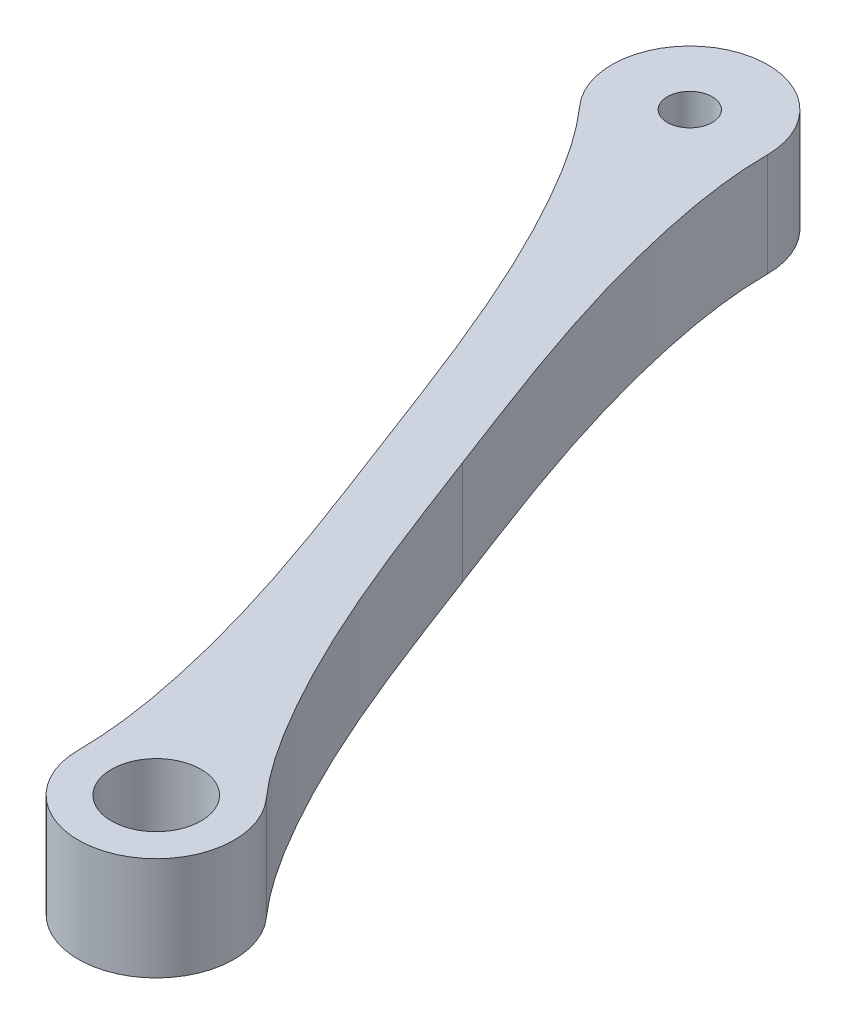
ISO-10303-21;
HEADER;
FILE_DESCRIPTION(('STEP AP214'),'2;1');
FILE_NAME('part.step','',(''),(''),'','','');
FILE_SCHEMA(('AUTOMOTIVE_DESIGN { 1 0 10303 214 1 1 1 1 }'));
ENDSEC;
DATA;
#1=APPLICATION_CONTEXT('core data for automotive mechanical design processes');
#2=APPLICATION_PROTOCOL_DEFINITION('international standard','automotive_design',2000,#1);
#3=PRODUCT_CONTEXT('',#1,'mechanical');
#4=PRODUCT('Part','Part','',(#3));
#5=PRODUCT_RELATED_PRODUCT_CATEGORY('part','',(#4));
#6=PRODUCT_DEFINITION_FORMATION('','',#4);
#7=PRODUCT_DEFINITION_CONTEXT('part definition',#1,'design');
#8=PRODUCT_DEFINITION('design','',#6,#7);
#9=PRODUCT_DEFINITION_SHAPE('','',#8);
#10=(LENGTH_UNIT() NAMED_UNIT(*) SI_UNIT(.MILLI.,.METRE.));
#11=(NAMED_UNIT(*) PLANE_ANGLE_UNIT() SI_UNIT($,.RADIAN.));
#12=(NAMED_UNIT(*) SI_UNIT($,.STERADIAN.) SOLID_ANGLE_UNIT());
#13=UNCERTAINTY_MEASURE_WITH_UNIT(LENGTH_MEASURE(1.E-05),#10,'distance_accuracy_value','');
#14=(GEOMETRIC_REPRESENTATION_CONTEXT(3) GLOBAL_UNCERTAINTY_ASSIGNED_CONTEXT((#13)) GLOBAL_UNIT_ASSIGNED_CONTEXT((#10,
#11,#12)) REPRESENTATION_CONTEXT('',''));
#15=CARTESIAN_POINT('',(0.,0.,0.));
#16=DIRECTION('',(0.,0.,1.));
#17=DIRECTION('',(1.,0.,0.));
#18=AXIS2_PLACEMENT_3D('',#15,#16,#17);
#19=CARTESIAN_POINT('',(-7.34,3.3655,-56.0881796816406));
#20=DIRECTION('',(0.,-1.,0.));
#21=DIRECTION('',(0.,0.,-1.));
#22=AXIS2_PLACEMENT_3D('',#19,#20,#21);
#23=CYLINDRICAL_SURFACE('',#22,5.07999999999992);
#24=DIRECTION('',(0.,-1.,0.));
#25=VECTOR('',#24,1.);
#26=CARTESIAN_POINT('',(-2.26000000000007,3.3655,-56.0881796816405));
#27=LINE('',#26,#25);
#28=CARTESIAN_POINT('',(-2.26000000000007,3.3655,-56.0881796816405));
#29=VERTEX_POINT('',#28);
#30=CARTESIAN_POINT('',(-2.26000000000007,-3.3655,-56.0881796816405));
#31=VERTEX_POINT('',#30);
#32=EDGE_CURVE('E48',#29,#31,#27,.T.);
#33=ORIENTED_EDGE('',*,*,#32,.T.);
#34=CARTESIAN_POINT('',(-7.34,-3.3655,-56.0881796816406));
#35=DIRECTION('',(0.,1.,0.));
#36=DIRECTION('',(0.,0.,1.));
#37=AXIS2_PLACEMENT_3D('',#34,#35,#36);
#38=CIRCLE('',#37,5.07999999999992);
#39=CARTESIAN_POINT('',(-11.138383451111,-3.3655,-52.7149493073072));
#40=VERTEX_POINT('',#39);
#41=EDGE_CURVE('E101',#31,#40,#38,.T.);
#42=ORIENTED_EDGE('',*,*,#41,.T.);
#43=DIRECTION('',(0.,-1.,0.));
#44=VECTOR('',#43,1.);
#45=CARTESIAN_POINT('',(-11.138383451111,3.3655,-52.7149493073072));
#46=LINE('',#45,#44);
#47=CARTESIAN_POINT('',(-11.138383451111,3.3655,-52.7149493073072));
#48=VERTEX_POINT('',#47);
#49=EDGE_CURVE('E11',#48,#40,#46,.T.);
#50=ORIENTED_EDGE('',*,*,#49,.F.);
#51=CARTESIAN_POINT('',(-7.34,3.3655,-56.0881796816406));
#52=DIRECTION('',(0.,1.,0.));
#53=DIRECTION('',(0.,0.,1.));
#54=AXIS2_PLACEMENT_3D('',#51,#52,#53);
#55=CIRCLE('',#54,5.07999999999992);
#56=EDGE_CURVE('E139',#29,#48,#55,.T.);
#57=ORIENTED_EDGE('',*,*,#56,.F.);
#58=EDGE_LOOP('',(#33,#42,#50,#57));
#59=FACE_BOUND('',#58,.T.);
#60=ADVANCED_FACE('F34',(#59),#23,.T.);
#61=CARTESIAN_POINT('',(-11.138383451111,3.3655,-52.7149493073072));
#62=CARTESIAN_POINT('',(-9.50821387946382,3.3655,-50.8793174540653));
#63=CARTESIAN_POINT('',(-4.23885877204082,3.3655,-42.5526907678336));
#64=CARTESIAN_POINT('',(-1.05277113928019,3.3655,-33.9089576244069));
#65=CARTESIAN_POINT('',(1.44539401061199,3.3655,-27.3337565074869));
#66=B_SPLINE_CURVE_WITH_KNOTS('',3,(#61,#62,#63,#64,#65),.UNSPECIFIED.,.F.,.F.,(4,1,4),(0.,
0.271179614196356,1.),.UNSPECIFIED.);
#67=DIRECTION('',(0.,-1.,0.));
#68=VECTOR('',#67,1.);
#69=SURFACE_OF_LINEAR_EXTRUSION('',#66,#68);
#70=ORIENTED_EDGE('',*,*,#49,.T.);
#71=CARTESIAN_POINT('',(-11.138383451111,-3.3655,-52.7149493073072));
#72=CARTESIAN_POINT('',(-9.50821387946382,-3.3655,-50.8793174540653));
#73=CARTESIAN_POINT('',(-4.23885877204082,-3.3655,-42.5526907678336));
#74=CARTESIAN_POINT('',(-1.05277113928019,-3.3655,-33.9089576244069));
#75=CARTESIAN_POINT('',(1.44539401061199,-3.3655,-27.3337565074869));
#76=B_SPLINE_CURVE_WITH_KNOTS('',3,(#71,#72,#73,#74,#75),.UNSPECIFIED.,.F.,.F.,(4,1,4),(0.,
0.271179614196356,1.),.UNSPECIFIED.);
#77=CARTESIAN_POINT('',(1.44539401061198,-3.3655,-27.333756507487));
#78=VERTEX_POINT('',#77);
#79=EDGE_CURVE('E90',#40,#78,#76,.T.);
#80=ORIENTED_EDGE('',*,*,#79,.T.);
#81=DIRECTION('',(0.,-1.,0.));
#82=VECTOR('',#81,1.);
#83=CARTESIAN_POINT('',(1.44539401061198,3.3655,-27.333756507487));
#84=LINE('',#83,#82);
#85=CARTESIAN_POINT('',(1.44539401061198,3.3655,-27.333756507487));
#86=VERTEX_POINT('',#85);
#87=EDGE_CURVE('E41',#86,#78,#84,.T.);
#88=ORIENTED_EDGE('',*,*,#87,.F.);
#89=EDGE_CURVE('E91',#48,#86,#66,.T.);
#90=ORIENTED_EDGE('',*,*,#89,.F.);
#91=EDGE_LOOP('',(#70,#80,#88,#90));
#92=FACE_BOUND('',#91,.T.);
#93=ADVANCED_FACE('F88',(#92),#69,.F.);
#94=CARTESIAN_POINT('',(8.89000000000007,3.3655,0.));
#95=CARTESIAN_POINT('',(8.89000000000007,3.3655,-2.45499432442545));
#96=CARTESIAN_POINT('',(7.30090574494729,3.3655,-12.1798899366441));
#97=CARTESIAN_POINT('',(3.94355916050416,3.3655,-20.758555390567));
#98=CARTESIAN_POINT('',(1.44539401061198,3.3655,-27.333756507487));
#99=B_SPLINE_CURVE_WITH_KNOTS('',3,(#94,#95,#96,#97,#98),.UNSPECIFIED.,.F.,.F.,(4,1,4),(0.,
0.271179614196356,1.),.UNSPECIFIED.);
#100=DIRECTION('',(0.,-1.,0.));
#101=VECTOR('',#100,1.);
#102=SURFACE_OF_LINEAR_EXTRUSION('',#99,#101);
#103=ORIENTED_EDGE('',*,*,#87,.T.);
#104=CARTESIAN_POINT('',(8.89000000000007,-3.3655,0.));
#105=CARTESIAN_POINT('',(8.89000000000007,-3.3655,-2.45499432442545));
#106=CARTESIAN_POINT('',(7.30090574494729,-3.3655,-12.1798899366441));
#107=CARTESIAN_POINT('',(3.94355916050416,-3.3655,-20.758555390567));
#108=CARTESIAN_POINT('',(1.44539401061198,-3.3655,-27.333756507487));
#109=B_SPLINE_CURVE_WITH_KNOTS('',3,(#104,#105,#106,#107,#108),.UNSPECIFIED.,.F.,.F.,(4,1,4),
(0.,0.271179614196356,1.),.UNSPECIFIED.);
#110=CARTESIAN_POINT('',(8.89000000000008,-3.3655,0.));
#111=VERTEX_POINT('',#110);
#112=EDGE_CURVE('E104',#111,#78,#109,.T.);
#113=ORIENTED_EDGE('',*,*,#112,.F.);
#114=DIRECTION('',(0.,-1.,0.));
#115=VECTOR('',#114,1.);
#116=CARTESIAN_POINT('',(8.89000000000008,3.3655,0.));
#117=LINE('',#116,#115);
#118=CARTESIAN_POINT('',(8.89000000000008,3.3655,0.));
#119=VERTEX_POINT('',#118);
#120=EDGE_CURVE('E194',#119,#111,#117,.T.);
#121=ORIENTED_EDGE('',*,*,#120,.F.);
#122=EDGE_CURVE('E148',#119,#86,#99,.T.);
#123=ORIENTED_EDGE('',*,*,#122,.T.);
#124=EDGE_LOOP('',(#103,#113,#121,#123));
#125=FACE_BOUND('',#124,.T.);
#126=ADVANCED_FACE('F158',(#125),#102,.T.);
#127=CARTESIAN_POINT('',(13.97,3.3655,0.));
#128=DIRECTION('',(0.,-1.,0.));
#129=DIRECTION('',(0.,0.,-1.));
#130=AXIS2_PLACEMENT_3D('',#127,#128,#129);
#131=CYLINDRICAL_SURFACE('',#130,5.07999999999992);
#132=ORIENTED_EDGE('',*,*,#120,.T.);
#133=CARTESIAN_POINT('',(13.97,-3.3655,0.));
#134=DIRECTION('',(0.,1.,0.));
#135=DIRECTION('',(0.,0.,1.));
#136=AXIS2_PLACEMENT_3D('',#133,#134,#135);
#137=CIRCLE('',#136,5.07999999999992);
#138=CARTESIAN_POINT('',(17.768383451111,-3.3655,-3.37323037433334));
#139=VERTEX_POINT('',#138);
#140=EDGE_CURVE('E121',#111,#139,#137,.T.);
#141=ORIENTED_EDGE('',*,*,#140,.T.);
#142=DIRECTION('',(0.,-1.,0.));
#143=VECTOR('',#142,1.);
#144=CARTESIAN_POINT('',(17.768383451111,3.3655,-3.37323037433334));
#145=LINE('',#144,#143);
#146=CARTESIAN_POINT('',(17.768383451111,3.3655,-3.37323037433334));
#147=VERTEX_POINT('',#146);
#148=EDGE_CURVE('E192',#147,#139,#145,.T.);
#149=ORIENTED_EDGE('',*,*,#148,.F.);
#150=CARTESIAN_POINT('',(13.97,3.3655,0.));
#151=DIRECTION('',(0.,1.,0.));
#152=DIRECTION('',(0.,0.,1.));
#153=AXIS2_PLACEMENT_3D('',#150,#151,#152);
#154=CIRCLE('',#153,5.07999999999992);
#155=EDGE_CURVE('E178',#119,#147,#154,.T.);
#156=ORIENTED_EDGE('',*,*,#155,.F.);
#157=EDGE_LOOP('',(#132,#141,#149,#156));
#158=FACE_BOUND('',#157,.T.);
#159=ADVANCED_FACE('F161',(#158),#131,.T.);
#160=CARTESIAN_POINT('',(17.768383451111,3.3655,-3.37323037433334));
#161=CARTESIAN_POINT('',(16.1382138794638,3.3655,-5.2088622275753));
#162=CARTESIAN_POINT('',(10.8688587720409,3.3655,-13.535488913807));
#163=CARTESIAN_POINT('',(7.68277113928019,3.3655,-22.1792220572336));
#164=CARTESIAN_POINT('',(5.18460598938802,3.3655,-28.7544231741536));
#165=B_SPLINE_CURVE_WITH_KNOTS('',3,(#160,#161,#162,#163,#164),.UNSPECIFIED.,.F.,.F.,(4,1,4),
(0.,0.271179614196356,1.),.UNSPECIFIED.);
#166=DIRECTION('',(0.,-1.,0.));
#167=VECTOR('',#166,1.);
#168=SURFACE_OF_LINEAR_EXTRUSION('',#165,#167);
#169=ORIENTED_EDGE('',*,*,#148,.T.);
#170=CARTESIAN_POINT('',(17.768383451111,-3.3655,-3.37323037433334));
#171=CARTESIAN_POINT('',(16.1382138794638,-3.3655,-5.2088622275753));
#172=CARTESIAN_POINT('',(10.8688587720409,-3.3655,-13.535488913807));
#173=CARTESIAN_POINT('',(7.68277113928019,-3.3655,-22.1792220572336));
#174=CARTESIAN_POINT('',(5.18460598938802,-3.3655,-28.7544231741536));
#175=B_SPLINE_CURVE_WITH_KNOTS('',3,(#170,#171,#172,#173,#174),.UNSPECIFIED.,.F.,.F.,(4,1,4),
(0.,0.271179614196356,1.),.UNSPECIFIED.);
#176=CARTESIAN_POINT('',(5.18460598938802,-3.3655,-28.7544231741536));
#177=VERTEX_POINT('',#176);
#178=EDGE_CURVE('E127',#139,#177,#175,.T.);
#179=ORIENTED_EDGE('',*,*,#178,.T.);
#180=DIRECTION('',(0.,-1.,0.));
#181=VECTOR('',#180,1.);
#182=CARTESIAN_POINT('',(5.18460598938802,3.3655,-28.7544231741536));
#183=LINE('',#182,#181);
#184=CARTESIAN_POINT('',(5.18460598938802,3.3655,-28.7544231741536));
#185=VERTEX_POINT('',#184);
#186=EDGE_CURVE('E190',#185,#177,#183,.T.);
#187=ORIENTED_EDGE('',*,*,#186,.F.);
#188=EDGE_CURVE('E56',#147,#185,#165,.T.);
#189=ORIENTED_EDGE('',*,*,#188,.F.);
#190=EDGE_LOOP('',(#169,#179,#187,#189));
#191=FACE_BOUND('',#190,.T.);
#192=ADVANCED_FACE('F165',(#191),#168,.F.);
#193=CARTESIAN_POINT('',(-2.26000000000007,3.3655,-56.0881796816405));
#194=CARTESIAN_POINT('',(-2.26000000000007,3.3655,-53.6331853572151));
#195=CARTESIAN_POINT('',(-0.670905744947262,3.3655,-43.9082897449965));
#196=CARTESIAN_POINT('',(2.68644083949585,3.3655,-35.3296242910736));
#197=CARTESIAN_POINT('',(5.18460598938802,3.3655,-28.7544231741536));
#198=B_SPLINE_CURVE_WITH_KNOTS('',3,(#193,#194,#195,#196,#197),.UNSPECIFIED.,.F.,.F.,(4,1,4),
(0.,0.271179614196356,1.),.UNSPECIFIED.);
#199=DIRECTION('',(0.,-1.,0.));
#200=VECTOR('',#199,1.);
#201=SURFACE_OF_LINEAR_EXTRUSION('',#198,#200);
#202=ORIENTED_EDGE('',*,*,#186,.T.);
#203=CARTESIAN_POINT('',(-2.26000000000007,-3.3655,-56.0881796816405));
#204=CARTESIAN_POINT('',(-2.26000000000007,-3.3655,-53.6331853572151));
#205=CARTESIAN_POINT('',(-0.670905744947262,-3.3655,-43.9082897449965));
#206=CARTESIAN_POINT('',(2.68644083949585,-3.3655,-35.3296242910736));
#207=CARTESIAN_POINT('',(5.18460598938802,-3.3655,-28.7544231741536));
#208=B_SPLINE_CURVE_WITH_KNOTS('',3,(#203,#204,#205,#206,#207),.UNSPECIFIED.,.F.,.F.,(4,1,4),
(0.,0.271179614196356,1.),.UNSPECIFIED.);
#209=EDGE_CURVE('E132',#31,#177,#208,.T.);
#210=ORIENTED_EDGE('',*,*,#209,.F.);
#211=ORIENTED_EDGE('',*,*,#32,.F.);
#212=EDGE_CURVE('E177',#29,#185,#198,.T.);
#213=ORIENTED_EDGE('',*,*,#212,.T.);
#214=EDGE_LOOP('',(#202,#210,#211,#213));
#215=FACE_BOUND('',#214,.T.);
#216=ADVANCED_FACE('F170',(#215),#201,.T.);
#217=CARTESIAN_POINT('',(0.,3.3655,0.));
#218=DIRECTION('',(0.,1.,0.));
#219=DIRECTION('',(0.,0.,1.));
#220=AXIS2_PLACEMENT_3D('',#217,#218,#219);
#221=PLANE('',#220);
#222=ORIENTED_EDGE('',*,*,#56,.T.);
#223=ORIENTED_EDGE('',*,*,#89,.T.);
#224=ORIENTED_EDGE('',*,*,#122,.F.);
#225=ORIENTED_EDGE('',*,*,#155,.T.);
#226=ORIENTED_EDGE('',*,*,#188,.T.);
#227=ORIENTED_EDGE('',*,*,#212,.F.);
#228=EDGE_LOOP('',(#222,#223,#224,#225,#226,#227));
#229=FACE_BOUND('',#228,.T.);
#230=CARTESIAN_POINT('',(-7.34,3.3655,-56.0881796816406));
#231=DIRECTION('',(0.,1.,0.));
#232=DIRECTION('',(0.,0.,1.));
#233=AXIS2_PLACEMENT_3D('',#230,#231,#232);
#234=CIRCLE('',#233,1.4605);
#235=CARTESIAN_POINT('',(-7.34,3.3655,-54.6276796816406));
#236=VERTEX_POINT('',#235);
#237=EDGE_CURVE('E109',#236,#236,#234,.T.);
#238=ORIENTED_EDGE('',*,*,#237,.F.);
#239=EDGE_LOOP('',(#238));
#240=FACE_BOUND('',#239,.T.);
#241=CARTESIAN_POINT('',(13.97,3.3655,0.));
#242=DIRECTION('',(0.,1.,0.));
#243=DIRECTION('',(0.,0.,1.));
#244=AXIS2_PLACEMENT_3D('',#241,#242,#243);
#245=CIRCLE('',#244,2.921);
#246=CARTESIAN_POINT('',(13.97,3.3655,2.921));
#247=VERTEX_POINT('',#246);
#248=EDGE_CURVE('E277',#247,#247,#245,.T.);
#249=ORIENTED_EDGE('',*,*,#248,.F.);
#250=EDGE_LOOP('',(#249));
#251=FACE_BOUND('',#250,.T.);
#252=ADVANCED_FACE('F199',(#229,#240,#251),#221,.T.);
#253=CARTESIAN_POINT('',(0.,-3.3655,0.));
#254=DIRECTION('',(0.,1.,0.));
#255=DIRECTION('',(0.,0.,1.));
#256=AXIS2_PLACEMENT_3D('',#253,#254,#255);
#257=PLANE('',#256);
#258=ORIENTED_EDGE('',*,*,#41,.F.);
#259=ORIENTED_EDGE('',*,*,#209,.T.);
#260=ORIENTED_EDGE('',*,*,#178,.F.);
#261=ORIENTED_EDGE('',*,*,#140,.F.);
#262=ORIENTED_EDGE('',*,*,#112,.T.);
#263=ORIENTED_EDGE('',*,*,#79,.F.);
#264=EDGE_LOOP('',(#258,#259,#260,#261,#262,#263));
#265=FACE_BOUND('',#264,.T.);
#266=CARTESIAN_POINT('',(-7.34,-3.3655,-56.0881796816406));
#267=DIRECTION('',(0.,1.,0.));
#268=DIRECTION('',(0.,0.,1.));
#269=AXIS2_PLACEMENT_3D('',#266,#267,#268);
#270=CIRCLE('',#269,1.4605);
#271=CARTESIAN_POINT('',(-7.34,-3.3655,-54.6276796816406));
#272=VERTEX_POINT('',#271);
#273=EDGE_CURVE('E106',#272,#272,#270,.F.);
#274=ORIENTED_EDGE('',*,*,#273,.F.);
#275=EDGE_LOOP('',(#274));
#276=FACE_BOUND('',#275,.T.);
#277=CARTESIAN_POINT('',(13.97,-3.3655,0.));
#278=DIRECTION('',(0.,1.,0.));
#279=DIRECTION('',(0.,0.,1.));
#280=AXIS2_PLACEMENT_3D('',#277,#278,#279);
#281=CIRCLE('',#280,2.921);
#282=CARTESIAN_POINT('',(13.97,-3.3655,2.921));
#283=VERTEX_POINT('',#282);
#284=EDGE_CURVE('E274',#283,#283,#281,.F.);
#285=ORIENTED_EDGE('',*,*,#284,.F.);
#286=EDGE_LOOP('',(#285));
#287=FACE_BOUND('',#286,.T.);
#288=ADVANCED_FACE('F98',(#265,#276,#287),#257,.F.);
#289=CARTESIAN_POINT('',(-7.34,-12.3457561210692,-56.0881796816406));
#290=DIRECTION('',(0.,1.,0.));
#291=DIRECTION('',(0.,0.,1.));
#292=AXIS2_PLACEMENT_3D('',#289,#290,#291);
#293=CYLINDRICAL_SURFACE('',#292,1.4605);
#294=ORIENTED_EDGE('',*,*,#273,.T.);
#295=EDGE_LOOP('',(#294));
#296=FACE_BOUND('',#295,.T.);
#297=ORIENTED_EDGE('',*,*,#237,.T.);
#298=EDGE_LOOP('',(#297));
#299=FACE_BOUND('',#298,.T.);
#300=ADVANCED_FACE('F248',(#296,#299),#293,.F.);
#301=CARTESIAN_POINT('',(13.97,-12.3457561210692,0.));
#302=DIRECTION('',(0.,1.,0.));
#303=DIRECTION('',(0.,0.,1.));
#304=AXIS2_PLACEMENT_3D('',#301,#302,#303);
#305=CYLINDRICAL_SURFACE('',#304,2.921);
#306=ORIENTED_EDGE('',*,*,#284,.T.);
#307=EDGE_LOOP('',(#306));
#308=FACE_BOUND('',#307,.T.);
#309=ORIENTED_EDGE('',*,*,#248,.T.);
#310=EDGE_LOOP('',(#309));
#311=FACE_BOUND('',#310,.T.);
#312=ADVANCED_FACE('F257',(#308,#311),#305,.F.);
#313=CLOSED_SHELL('',(#60,#93,#126,#159,#192,#216,#252,#288,#300,#312));
#314=MANIFOLD_SOLID_BREP('B2',#313);
#315=ADVANCED_BREP_SHAPE_REPRESENTATION('',(#18,#314),#14);
#316=SHAPE_DEFINITION_REPRESENTATION(#9,#315);
ENDSEC;
END-ISO-10303-21;
